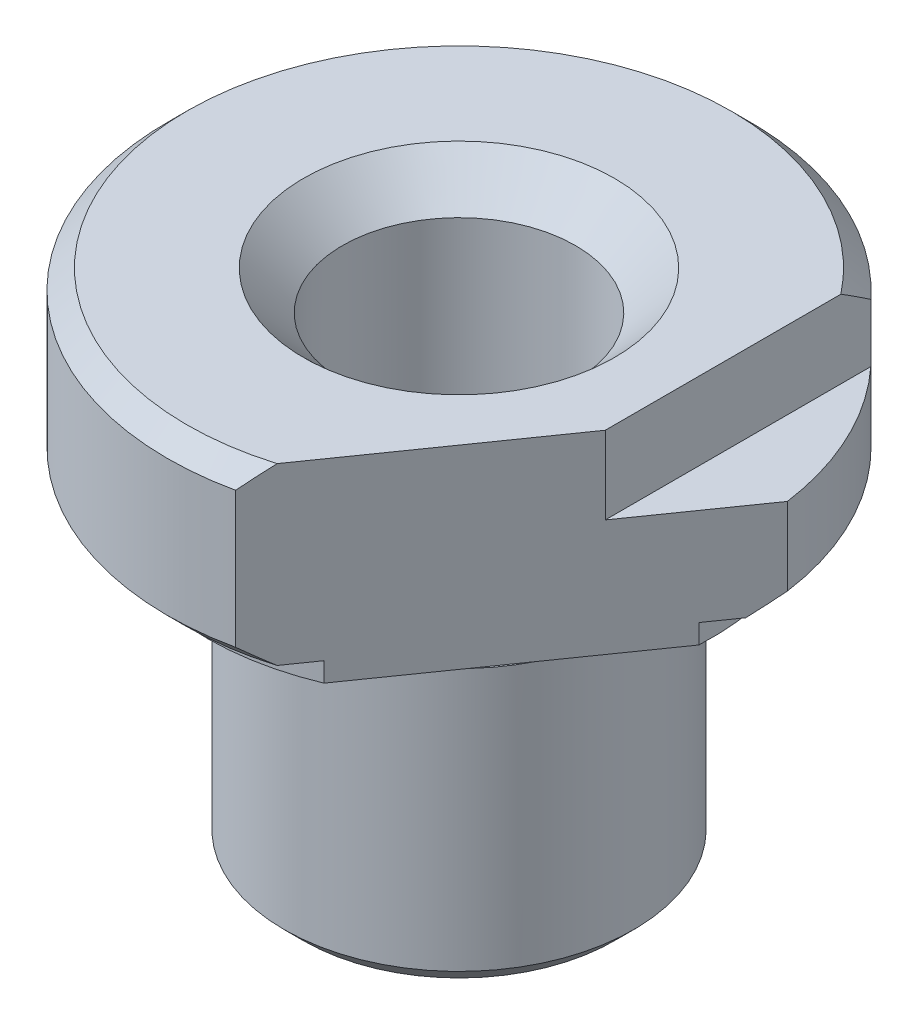
ISO-10303-21;
HEADER;
FILE_DESCRIPTION(('STEP AP214'),'2;1');
FILE_NAME('part.step','',(''),(''),'','','');
FILE_SCHEMA(('AUTOMOTIVE_DESIGN { 1 0 10303 214 1 1 1 1 }'));
ENDSEC;
DATA;
#1=APPLICATION_CONTEXT('core data for automotive mechanical design processes');
#2=APPLICATION_PROTOCOL_DEFINITION('international standard','automotive_design',2000,#1);
#3=PRODUCT_CONTEXT('',#1,'mechanical');
#4=PRODUCT('Part','Part','',(#3));
#5=PRODUCT_RELATED_PRODUCT_CATEGORY('part','',(#4));
#6=PRODUCT_DEFINITION_FORMATION('','',#4);
#7=PRODUCT_DEFINITION_CONTEXT('part definition',#1,'design');
#8=PRODUCT_DEFINITION('design','',#6,#7);
#9=PRODUCT_DEFINITION_SHAPE('','',#8);
#10=(LENGTH_UNIT() NAMED_UNIT(*) SI_UNIT(.MILLI.,.METRE.));
#11=(NAMED_UNIT(*) PLANE_ANGLE_UNIT() SI_UNIT($,.RADIAN.));
#12=(NAMED_UNIT(*) SI_UNIT($,.STERADIAN.) SOLID_ANGLE_UNIT());
#13=UNCERTAINTY_MEASURE_WITH_UNIT(LENGTH_MEASURE(1.E-05),#10,'distance_accuracy_value','');
#14=(GEOMETRIC_REPRESENTATION_CONTEXT(3) GLOBAL_UNCERTAINTY_ASSIGNED_CONTEXT((#13)) GLOBAL_UNIT_ASSIGNED_CONTEXT((#10,
#11,#12)) REPRESENTATION_CONTEXT('',''));
#15=CARTESIAN_POINT('',(0.,0.,0.));
#16=DIRECTION('',(0.,0.,1.));
#17=DIRECTION('',(1.,0.,0.));
#18=AXIS2_PLACEMENT_3D('',#15,#16,#17);
#19=CARTESIAN_POINT('',(0.,26.,0.));
#20=DIRECTION('',(0.,1.,0.));
#21=DIRECTION('',(0.,0.,1.));
#22=AXIS2_PLACEMENT_3D('',#19,#20,#21);
#23=CYLINDRICAL_SURFACE('',#22,8.);
#24=CARTESIAN_POINT('',(0.,16.5,0.));
#25=DIRECTION('',(0.,1.,0.));
#26=DIRECTION('',(0.,0.,1.));
#27=AXIS2_PLACEMENT_3D('',#24,#25,#26);
#28=CIRCLE('',#27,8.);
#29=CARTESIAN_POINT('',(0.,16.5,8.));
#30=VERTEX_POINT('',#29);
#31=EDGE_CURVE('E134',#30,#30,#28,.T.);
#32=ORIENTED_EDGE('',*,*,#31,.F.);
#33=EDGE_LOOP('',(#32));
#34=FACE_BOUND('',#33,.T.);
#35=CARTESIAN_POINT('',(0.,15.,0.));
#36=DIRECTION('',(0.,1.,0.));
#37=DIRECTION('',(0.,0.,1.));
#38=AXIS2_PLACEMENT_3D('',#35,#36,#37);
#39=CIRCLE('',#38,8.);
#40=CARTESIAN_POINT('',(0.,15.,8.));
#41=VERTEX_POINT('',#40);
#42=EDGE_CURVE('E137',#41,#41,#39,.T.);
#43=ORIENTED_EDGE('',*,*,#42,.T.);
#44=EDGE_LOOP('',(#43));
#45=FACE_BOUND('',#44,.T.);
#46=ADVANCED_FACE('F40',(#34,#45),#23,.T.);
#47=CARTESIAN_POINT('',(0.,16.5,0.));
#48=DIRECTION('',(0.,1.,0.));
#49=DIRECTION('',(0.,0.,1.));
#50=AXIS2_PLACEMENT_3D('',#47,#48,#49);
#51=PLANE('',#50);
#52=CARTESIAN_POINT('',(0.,16.5,0.));
#53=DIRECTION('',(0.,1.,0.));
#54=DIRECTION('',(0.,0.,1.));
#55=AXIS2_PLACEMENT_3D('',#52,#53,#54);
#56=CIRCLE('',#55,10.);
#57=CARTESIAN_POINT('',(0.,16.5,10.));
#58=VERTEX_POINT('',#57);
#59=EDGE_CURVE('E149',#58,#58,#56,.T.);
#60=ORIENTED_EDGE('',*,*,#59,.F.);
#61=EDGE_LOOP('',(#60));
#62=FACE_BOUND('',#61,.T.);
#63=ORIENTED_EDGE('',*,*,#31,.T.);
#64=EDGE_LOOP('',(#63));
#65=FACE_BOUND('',#64,.T.);
#66=ADVANCED_FACE('F197',(#62,#65),#51,.F.);
#67=CARTESIAN_POINT('',(0.,15.,0.));
#68=DIRECTION('',(0.,-1.,0.));
#69=DIRECTION('',(0.,0.,-1.));
#70=AXIS2_PLACEMENT_3D('',#67,#68,#69);
#71=PLANE('',#70);
#72=CARTESIAN_POINT('',(0.,15.,0.));
#73=DIRECTION('',(0.,-1.,0.));
#74=DIRECTION('',(0.,0.,-1.));
#75=AXIS2_PLACEMENT_3D('',#72,#73,#74);
#76=CIRCLE('',#75,8.49999999999999);
#77=CARTESIAN_POINT('',(0.,15.,-8.49999999999999));
#78=VERTEX_POINT('',#77);
#79=EDGE_CURVE('E179',#78,#78,#76,.F.);
#80=ORIENTED_EDGE('',*,*,#79,.T.);
#81=EDGE_LOOP('',(#80));
#82=FACE_BOUND('',#81,.T.);
#83=ORIENTED_EDGE('',*,*,#42,.F.);
#84=EDGE_LOOP('',(#83));
#85=FACE_BOUND('',#84,.T.);
#86=ADVANCED_FACE('F199',(#82,#85),#71,.F.);
#87=CARTESIAN_POINT('',(0.,26.,0.));
#88=DIRECTION('',(0.,1.,0.));
#89=DIRECTION('',(0.,0.,1.));
#90=AXIS2_PLACEMENT_3D('',#87,#88,#89);
#91=CYLINDRICAL_SURFACE('',#90,9.);
#92=CARTESIAN_POINT('',(0.,14.5,0.));
#93=DIRECTION('',(0.,-1.,0.));
#94=DIRECTION('',(0.,0.,-1.));
#95=AXIS2_PLACEMENT_3D('',#92,#93,#94);
#96=CIRCLE('',#95,9.);
#97=CARTESIAN_POINT('',(0.,14.5,-9.));
#98=VERTEX_POINT('',#97);
#99=EDGE_CURVE('E278',#98,#98,#96,.T.);
#100=ORIENTED_EDGE('',*,*,#99,.T.);
#101=EDGE_LOOP('',(#100));
#102=FACE_BOUND('',#101,.T.);
#103=CARTESIAN_POINT('',(0.,1.00000000000001,0.));
#104=DIRECTION('',(0.,1.,0.));
#105=DIRECTION('',(0.,0.,1.));
#106=AXIS2_PLACEMENT_3D('',#103,#104,#105);
#107=CIRCLE('',#106,9.);
#108=CARTESIAN_POINT('',(0.,1.00000000000001,9.));
#109=VERTEX_POINT('',#108);
#110=EDGE_CURVE('E158',#109,#109,#107,.T.);
#111=ORIENTED_EDGE('',*,*,#110,.T.);
#112=EDGE_LOOP('',(#111));
#113=FACE_BOUND('',#112,.T.);
#114=ADVANCED_FACE('F202',(#102,#113),#91,.T.);
#115=CARTESIAN_POINT('',(0.,0.,0.));
#116=DIRECTION('',(0.,1.,0.));
#117=DIRECTION('',(0.,0.,1.));
#118=AXIS2_PLACEMENT_3D('',#115,#116,#117);
#119=PLANE('',#118);
#120=CARTESIAN_POINT('',(0.,0.,0.));
#121=DIRECTION('',(0.,1.,0.));
#122=DIRECTION('',(0.,0.,1.));
#123=AXIS2_PLACEMENT_3D('',#120,#121,#122);
#124=CIRCLE('',#123,6.5);
#125=CARTESIAN_POINT('',(0.,0.,6.5));
#126=VERTEX_POINT('',#125);
#127=EDGE_CURVE('E54',#126,#126,#124,.T.);
#128=ORIENTED_EDGE('',*,*,#127,.T.);
#129=EDGE_LOOP('',(#128));
#130=FACE_BOUND('',#129,.T.);
#131=CARTESIAN_POINT('',(0.,0.,0.));
#132=DIRECTION('',(0.,1.,0.));
#133=DIRECTION('',(0.,0.,1.));
#134=AXIS2_PLACEMENT_3D('',#131,#132,#133);
#135=CIRCLE('',#134,7.99999999999998);
#136=CARTESIAN_POINT('',(0.,0.,7.99999999999998));
#137=VERTEX_POINT('',#136);
#138=EDGE_CURVE('E161',#137,#137,#135,.F.);
#139=ORIENTED_EDGE('',*,*,#138,.T.);
#140=EDGE_LOOP('',(#139));
#141=FACE_BOUND('',#140,.T.);
#142=ADVANCED_FACE('F194',(#130,#141),#119,.F.);
#143=CARTESIAN_POINT('',(0.,26.,0.));
#144=DIRECTION('',(0.,1.,0.));
#145=DIRECTION('',(0.,0.,1.));
#146=AXIS2_PLACEMENT_3D('',#143,#144,#145);
#147=CYLINDRICAL_SURFACE('',#146,15.);
#148=CARTESIAN_POINT('',(0.,18.,0.));
#149=DIRECTION('',(0.,-1.,0.));
#150=DIRECTION('',(0.,0.,-1.));
#151=AXIS2_PLACEMENT_3D('',#148,#149,#150);
#152=CIRCLE('',#151,15.);
#153=CARTESIAN_POINT('',(14.8600273701609,18.,-2.0444037169964));
#154=VERTEX_POINT('',#153);
#155=CARTESIAN_POINT('',(3.16131760419685,18.,14.6630853167195));
#156=VERTEX_POINT('',#155);
#157=EDGE_CURVE('E166',#154,#156,#152,.F.);
#158=ORIENTED_EDGE('',*,*,#157,.T.);
#159=DIRECTION('',(0.,1.,0.));
#160=VECTOR('',#159,1.);
#161=CARTESIAN_POINT('',(3.16131760419685,16.,14.6630853167195));
#162=LINE('',#161,#160);
#163=CARTESIAN_POINT('',(3.16131760419685,25.,14.6630853167195));
#164=VERTEX_POINT('',#163);
#165=EDGE_CURVE('E255',#156,#164,#162,.T.);
#166=ORIENTED_EDGE('',*,*,#165,.T.);
#167=CARTESIAN_POINT('',(0.,25.,0.));
#168=DIRECTION('',(0.,-1.,0.));
#169=DIRECTION('',(0.,0.,-1.));
#170=AXIS2_PLACEMENT_3D('',#167,#168,#169);
#171=CIRCLE('',#170,15.);
#172=CARTESIAN_POINT('',(11.,25.,-10.1980390271856));
#173=VERTEX_POINT('',#172);
#174=EDGE_CURVE('E164',#164,#173,#171,.T.);
#175=ORIENTED_EDGE('',*,*,#174,.T.);
#176=DIRECTION('',(0.,1.,0.));
#177=VECTOR('',#176,1.);
#178=CARTESIAN_POINT('',(11.,22.,-10.1980390271856));
#179=LINE('',#178,#177);
#180=CARTESIAN_POINT('',(11.,22.,-10.1980390271856));
#181=VERTEX_POINT('',#180);
#182=EDGE_CURVE('E132',#181,#173,#179,.T.);
#183=ORIENTED_EDGE('',*,*,#182,.F.);
#184=CARTESIAN_POINT('',(0.,22.,0.));
#185=DIRECTION('',(0.,1.,0.));
#186=DIRECTION('',(0.,0.,1.));
#187=AXIS2_PLACEMENT_3D('',#184,#185,#186);
#188=CIRCLE('',#187,15.);
#189=CARTESIAN_POINT('',(14.8600273701609,22.,-2.0444037169964));
#190=VERTEX_POINT('',#189);
#191=EDGE_CURVE('E126',#190,#181,#188,.T.);
#192=ORIENTED_EDGE('',*,*,#191,.F.);
#193=DIRECTION('',(0.,1.,0.));
#194=VECTOR('',#193,1.);
#195=CARTESIAN_POINT('',(14.8600273701609,16.,-2.0444037169964));
#196=LINE('',#195,#194);
#197=EDGE_CURVE('E257',#154,#190,#196,.T.);
#198=ORIENTED_EDGE('',*,*,#197,.F.);
#199=EDGE_LOOP('',(#158,#166,#175,#183,#192,#198));
#200=FACE_BOUND('',#199,.T.);
#201=ADVANCED_FACE('F209',(#200),#147,.T.);
#202=CARTESIAN_POINT('',(0.,26.,0.));
#203=DIRECTION('',(0.,-1.,0.));
#204=DIRECTION('',(0.,0.,-1.));
#205=AXIS2_PLACEMENT_3D('',#202,#203,#204);
#206=PLANE('',#205);
#207=CARTESIAN_POINT('',(0.,26.,0.));
#208=DIRECTION('',(0.,-1.,0.));
#209=DIRECTION('',(0.,0.,-1.));
#210=AXIS2_PLACEMENT_3D('',#207,#208,#209);
#211=CIRCLE('',#210,8.);
#212=CARTESIAN_POINT('',(0.,26.,-8.));
#213=VERTEX_POINT('',#212);
#214=EDGE_CURVE('E152',#213,#213,#211,.T.);
#215=ORIENTED_EDGE('',*,*,#214,.T.);
#216=EDGE_LOOP('',(#215));
#217=FACE_BOUND('',#216,.T.);
#218=CARTESIAN_POINT('',(0.,26.,0.));
#219=DIRECTION('',(0.,-1.,0.));
#220=DIRECTION('',(0.,0.,-1.));
#221=AXIS2_PLACEMENT_3D('',#218,#219,#220);
#222=CIRCLE('',#221,14.);
#223=CARTESIAN_POINT('',(11.,26.,-8.66025403784439));
#224=VERTEX_POINT('',#223);
#225=CARTESIAN_POINT('',(4.0433548382573,26.,13.4034055990237));
#226=VERTEX_POINT('',#225);
#227=EDGE_CURVE('E122',#224,#226,#222,.F.);
#228=ORIENTED_EDGE('',*,*,#227,.T.);
#229=DIRECTION('',(-0.57357643635105,0.,0.819152044288989));
#230=VECTOR('',#229,1.);
#231=CARTESIAN_POINT('',(3.16131760419685,26.,14.6630853167195));
#232=LINE('',#231,#230);
#233=CARTESIAN_POINT('',(11.,26.,3.46828667766885));
#234=VERTEX_POINT('',#233);
#235=EDGE_CURVE('E60',#234,#226,#232,.T.);
#236=ORIENTED_EDGE('',*,*,#235,.F.);
#237=DIRECTION('',(0.,0.,1.));
#238=VECTOR('',#237,1.);
#239=CARTESIAN_POINT('',(11.,26.,-10.1980390271856));
#240=LINE('',#239,#238);
#241=EDGE_CURVE('E116',#224,#234,#240,.T.);
#242=ORIENTED_EDGE('',*,*,#241,.F.);
#243=EDGE_LOOP('',(#228,#236,#242));
#244=FACE_BOUND('',#243,.T.);
#245=ADVANCED_FACE('F120',(#217,#244),#206,.F.);
#246=CARTESIAN_POINT('',(0.,17.,0.));
#247=DIRECTION('',(0.,-1.,0.));
#248=DIRECTION('',(0.,0.,-1.));
#249=AXIS2_PLACEMENT_3D('',#246,#247,#248);
#250=PLANE('',#249);
#251=DIRECTION('',(0.57357643635105,0.,-0.819152044288989));
#252=VECTOR('',#251,1.);
#253=CARTESIAN_POINT('',(9.01067248717887,17.,6.30934079986156));
#254=LINE('',#253,#252);
#255=CARTESIAN_POINT('',(4.04335483825708,17.0000000000001,13.4034055990241));
#256=VERTEX_POINT('',#255);
#257=CARTESIAN_POINT('',(5.03681836804161,17.,11.9845926391913));
#258=VERTEX_POINT('',#257);
#259=EDGE_CURVE('E319',#256,#258,#254,.T.);
#260=ORIENTED_EDGE('',*,*,#259,.F.);
#261=CARTESIAN_POINT('',(0.,17.,0.));
#262=DIRECTION('',(0.,-1.,0.));
#263=DIRECTION('',(0.,0.,-1.));
#264=AXIS2_PLACEMENT_3D('',#261,#262,#263);
#265=CIRCLE('',#264,14.);
#266=CARTESIAN_POINT('',(13.9779901361004,17.,-0.784723999300637));
#267=VERTEX_POINT('',#266);
#268=EDGE_CURVE('E169',#256,#267,#265,.T.);
#269=ORIENTED_EDGE('',*,*,#268,.T.);
#270=CARTESIAN_POINT('',(12.9845266063161,17.,0.634088960531777));
#271=VERTEX_POINT('',#270);
#272=EDGE_CURVE('E254',#271,#267,#254,.T.);
#273=ORIENTED_EDGE('',*,*,#272,.F.);
#274=CARTESIAN_POINT('',(0.,17.,0.));
#275=DIRECTION('',(0.,1.,0.));
#276=DIRECTION('',(0.,0.,1.));
#277=AXIS2_PLACEMENT_3D('',#274,#275,#276);
#278=CIRCLE('',#277,13.);
#279=EDGE_CURVE('E140',#271,#258,#278,.T.);
#280=ORIENTED_EDGE('',*,*,#279,.T.);
#281=EDGE_LOOP('',(#260,#269,#273,#280));
#282=FACE_BOUND('',#281,.T.);
#283=ADVANCED_FACE('F213',(#282),#250,.T.);
#284=CARTESIAN_POINT('',(0.,26.,0.));
#285=DIRECTION('',(0.,1.,0.));
#286=DIRECTION('',(0.,0.,1.));
#287=AXIS2_PLACEMENT_3D('',#284,#285,#286);
#288=CYLINDRICAL_SURFACE('',#287,13.);
#289=DIRECTION('',(0.,1.,0.));
#290=VECTOR('',#289,1.);
#291=CARTESIAN_POINT('',(5.03681836804161,26.,11.9845926391913));
#292=LINE('',#291,#290);
#293=CARTESIAN_POINT('',(5.03681836804162,16.,11.9845926391913));
#294=VERTEX_POINT('',#293);
#295=EDGE_CURVE('E316',#258,#294,#292,.F.);
#296=ORIENTED_EDGE('',*,*,#295,.F.);
#297=ORIENTED_EDGE('',*,*,#279,.F.);
#298=DIRECTION('',(0.,1.,0.));
#299=VECTOR('',#298,1.);
#300=CARTESIAN_POINT('',(12.9845266063161,26.,0.634088960531781));
#301=LINE('',#300,#299);
#302=CARTESIAN_POINT('',(12.9845266063161,16.,0.634088960531784));
#303=VERTEX_POINT('',#302);
#304=EDGE_CURVE('E317',#303,#271,#301,.T.);
#305=ORIENTED_EDGE('',*,*,#304,.F.);
#306=CARTESIAN_POINT('',(0.,16.,0.));
#307=DIRECTION('',(0.,1.,0.));
#308=DIRECTION('',(0.,0.,1.));
#309=AXIS2_PLACEMENT_3D('',#306,#307,#308);
#310=CIRCLE('',#309,13.);
#311=EDGE_CURVE('E143',#303,#294,#310,.T.);
#312=ORIENTED_EDGE('',*,*,#311,.T.);
#313=EDGE_LOOP('',(#296,#297,#305,#312));
#314=FACE_BOUND('',#313,.T.);
#315=ADVANCED_FACE('F220',(#314),#288,.T.);
#316=CARTESIAN_POINT('',(0.,16.,0.));
#317=DIRECTION('',(0.,1.,0.));
#318=DIRECTION('',(0.,0.,1.));
#319=AXIS2_PLACEMENT_3D('',#316,#317,#318);
#320=PLANE('',#319);
#321=ORIENTED_EDGE('',*,*,#311,.F.);
#322=DIRECTION('',(-0.57357643635105,0.,0.819152044288989));
#323=VECTOR('',#322,1.);
#324=CARTESIAN_POINT('',(3.16131760419685,16.,14.6630853167195));
#325=LINE('',#324,#323);
#326=EDGE_CURVE('E123',#303,#294,#325,.T.);
#327=ORIENTED_EDGE('',*,*,#326,.T.);
#328=EDGE_LOOP('',(#321,#327));
#329=FACE_BOUND('',#328,.T.);
#330=CARTESIAN_POINT('',(0.,16.,0.));
#331=DIRECTION('',(0.,1.,0.));
#332=DIRECTION('',(0.,0.,1.));
#333=AXIS2_PLACEMENT_3D('',#330,#331,#332);
#334=CIRCLE('',#333,10.);
#335=CARTESIAN_POINT('',(0.,16.,10.));
#336=VERTEX_POINT('',#335);
#337=EDGE_CURVE('E146',#336,#336,#334,.T.);
#338=ORIENTED_EDGE('',*,*,#337,.T.);
#339=EDGE_LOOP('',(#338));
#340=FACE_BOUND('',#339,.T.);
#341=ADVANCED_FACE('F224',(#329,#340),#320,.F.);
#342=CARTESIAN_POINT('',(0.,26.,0.));
#343=DIRECTION('',(0.,1.,0.));
#344=DIRECTION('',(0.,0.,1.));
#345=AXIS2_PLACEMENT_3D('',#342,#343,#344);
#346=CYLINDRICAL_SURFACE('',#345,10.);
#347=ORIENTED_EDGE('',*,*,#337,.F.);
#348=EDGE_LOOP('',(#347));
#349=FACE_BOUND('',#348,.T.);
#350=ORIENTED_EDGE('',*,*,#59,.T.);
#351=EDGE_LOOP('',(#350));
#352=FACE_BOUND('',#351,.T.);
#353=ADVANCED_FACE('F192',(#349,#352),#346,.F.);
#354=CARTESIAN_POINT('',(0.,26.,0.));
#355=DIRECTION('',(0.,-1.,0.));
#356=DIRECTION('',(0.,0.,-1.));
#357=AXIS2_PLACEMENT_3D('',#354,#355,#356);
#358=CYLINDRICAL_SURFACE('',#357,6.);
#359=CARTESIAN_POINT('',(0.,0.5,0.));
#360=DIRECTION('',(0.,1.,0.));
#361=DIRECTION('',(0.,0.,1.));
#362=AXIS2_PLACEMENT_3D('',#359,#360,#361);
#363=CIRCLE('',#362,6.);
#364=CARTESIAN_POINT('',(0.,0.5,6.));
#365=VERTEX_POINT('',#364);
#366=EDGE_CURVE('E277',#365,#365,#363,.F.);
#367=ORIENTED_EDGE('',*,*,#366,.T.);
#368=EDGE_LOOP('',(#367));
#369=FACE_BOUND('',#368,.T.);
#370=CARTESIAN_POINT('',(0.,24.,0.));
#371=DIRECTION('',(0.,-1.,0.));
#372=DIRECTION('',(0.,0.,-1.));
#373=AXIS2_PLACEMENT_3D('',#370,#371,#372);
#374=CIRCLE('',#373,6.);
#375=CARTESIAN_POINT('',(0.,24.,-6.));
#376=VERTEX_POINT('',#375);
#377=EDGE_CURVE('E155',#376,#376,#374,.F.);
#378=ORIENTED_EDGE('',*,*,#377,.T.);
#379=EDGE_LOOP('',(#378));
#380=FACE_BOUND('',#379,.T.);
#381=ADVANCED_FACE('F189',(#369,#380),#358,.F.);
#382=CARTESIAN_POINT('',(11.,22.,-10.1980390271856));
#383=DIRECTION('',(-1.,0.,0.));
#384=DIRECTION('',(0.,0.,1.));
#385=AXIS2_PLACEMENT_3D('',#382,#383,#384);
#386=PLANE('',#385);
#387=ORIENTED_EDGE('',*,*,#241,.T.);
#388=DIRECTION('',(0.,-1.,0.));
#389=VECTOR('',#388,1.);
#390=CARTESIAN_POINT('',(11.,22.,3.46828667766885));
#391=LINE('',#390,#389);
#392=CARTESIAN_POINT('',(11.,22.,3.46828667766884));
#393=VERTEX_POINT('',#392);
#394=EDGE_CURVE('E110',#234,#393,#391,.T.);
#395=ORIENTED_EDGE('',*,*,#394,.T.);
#396=DIRECTION('',(0.,0.,1.));
#397=VECTOR('',#396,1.);
#398=CARTESIAN_POINT('',(11.,22.,-10.1980390271856));
#399=LINE('',#398,#397);
#400=EDGE_CURVE('E128',#181,#393,#399,.T.);
#401=ORIENTED_EDGE('',*,*,#400,.F.);
#402=ORIENTED_EDGE('',*,*,#182,.T.);
#403=CARTESIAN_POINT('',(11.,25.,-10.1980390271856));
#404=CARTESIAN_POINT('',(11.,25.0859534985509,-10.0716097932226));
#405=CARTESIAN_POINT('',(11.,25.1713222713732,-9.94478168559514));
#406=CARTESIAN_POINT('',(11.,25.3407786548004,-9.69029386318123));
#407=CARTESIAN_POINT('',(11.,25.4248664125517,-9.56263424634969));
#408=CARTESIAN_POINT('',(11.,25.591670016424,-9.30641873923805));
#409=CARTESIAN_POINT('',(11.,25.6743858458112,-9.17786283805277));
#410=CARTESIAN_POINT('',(11.,25.8383361007494,-8.91978924484244));
#411=CARTESIAN_POINT('',(11.,25.9195703536757,-8.79027144318522));
#412=CARTESIAN_POINT('',(11.,26.,-8.66025403784439));
#413=B_SPLINE_CURVE_WITH_KNOTS('',3,(#403,#404,#405,#406,#407,#408,#409,#410,#411,#412),
.UNSPECIFIED.,.F.,.F.,(4,2,2,2,4),(0.,0.458640555019231,0.917228023923435,1.3758210822705,
1.83446723618275),.UNSPECIFIED.);
#414=EDGE_CURVE('E68',#173,#224,#413,.T.);
#415=ORIENTED_EDGE('',*,*,#414,.T.);
#416=EDGE_LOOP('',(#387,#395,#401,#402,#415));
#417=FACE_BOUND('',#416,.T.);
#418=ADVANCED_FACE('F125',(#417),#386,.F.);
#419=CARTESIAN_POINT('',(0.,22.,0.));
#420=DIRECTION('',(0.,1.,0.));
#421=DIRECTION('',(0.,0.,1.));
#422=AXIS2_PLACEMENT_3D('',#419,#420,#421);
#423=PLANE('',#422);
#424=DIRECTION('',(-0.57357643635105,0.,0.819152044288989));
#425=VECTOR('',#424,1.);
#426=CARTESIAN_POINT('',(9.01067248717888,22.,6.30934079986155));
#427=LINE('',#426,#425);
#428=EDGE_CURVE('E113',#190,#393,#427,.T.);
#429=ORIENTED_EDGE('',*,*,#428,.F.);
#430=ORIENTED_EDGE('',*,*,#191,.T.);
#431=ORIENTED_EDGE('',*,*,#400,.T.);
#432=EDGE_LOOP('',(#429,#430,#431));
#433=FACE_BOUND('',#432,.T.);
#434=ADVANCED_FACE('F188',(#433),#423,.T.);
#435=CARTESIAN_POINT('',(0.,26.,0.));
#436=DIRECTION('',(0.,1.,0.));
#437=DIRECTION('',(0.,0.,1.));
#438=AXIS2_PLACEMENT_3D('',#435,#436,#437);
#439=CONICAL_SURFACE('',#438,8.,0.785398163397447);
#440=ORIENTED_EDGE('',*,*,#377,.F.);
#441=EDGE_LOOP('',(#440));
#442=FACE_BOUND('',#441,.T.);
#443=ORIENTED_EDGE('',*,*,#214,.F.);
#444=EDGE_LOOP('',(#443));
#445=FACE_BOUND('',#444,.T.);
#446=ADVANCED_FACE('F235',(#442,#445),#439,.F.);
#447=CARTESIAN_POINT('',(0.,1.00000000000001,0.));
#448=DIRECTION('',(0.,1.,0.));
#449=DIRECTION('',(0.,0.,1.));
#450=AXIS2_PLACEMENT_3D('',#447,#448,#449);
#451=CONICAL_SURFACE('',#450,9.,0.785398163397453);
#452=ORIENTED_EDGE('',*,*,#138,.F.);
#453=EDGE_LOOP('',(#452));
#454=FACE_BOUND('',#453,.T.);
#455=ORIENTED_EDGE('',*,*,#110,.F.);
#456=EDGE_LOOP('',(#455));
#457=FACE_BOUND('',#456,.T.);
#458=ADVANCED_FACE('F238',(#454,#457),#451,.T.);
#459=CARTESIAN_POINT('',(0.,18.,0.));
#460=DIRECTION('',(0.,1.,0.));
#461=DIRECTION('',(0.,0.,1.));
#462=AXIS2_PLACEMENT_3D('',#459,#460,#461);
#463=CONICAL_SURFACE('',#462,15.,0.785398163397454);
#464=CARTESIAN_POINT('',(-5.29084725455643,30.2525467139973,26.7340277124036));
#465=CARTESIAN_POINT('',(-5.08043013339517,29.9169170292778,26.4335209202328));
#466=CARTESIAN_POINT('',(-4.86967343911738,29.5819327501249,26.1325291673924));
#467=CARTESIAN_POINT('',(-4.44738046274961,28.9134551953034,25.5294322949316));
#468=CARTESIAN_POINT('',(-4.23584417411731,28.5799619321994,25.2273271659677));
#469=CARTESIAN_POINT('',(-3.81184362216552,27.9145914661765,24.6217916228402));
#470=CARTESIAN_POINT('',(-3.59937914594874,27.5827146754166,24.3183609046277));
#471=CARTESIAN_POINT('',(-3.17345275225381,26.9209130745991,23.7100749744535));
#472=CARTESIAN_POINT('',(-2.95999083693992,26.5909882603098,23.4052197655826));
#473=CARTESIAN_POINT('',(-2.5304588240863,25.9311380560432,22.7917844775938));
#474=CARTESIAN_POINT('',(-2.31438087950258,25.6012281833536,22.4831931917356));
#475=CARTESIAN_POINT('',(-1.88089593842366,24.9440731737241,21.864112537181));
#476=CARTESIAN_POINT('',(-1.6634889452251,24.616828030179,21.5536231731927));
#477=CARTESIAN_POINT('',(-1.22716246521827,23.9655070421263,20.9304843804821));
#478=CARTESIAN_POINT('',(-1.00824316218532,23.6414308237034,20.6178352142183));
#479=CARTESIAN_POINT('',(-0.568614374505926,22.9969888729641,19.9899802373875));
#480=CARTESIAN_POINT('',(-0.347904897598934,22.6766231246208,19.6747744378737));
#481=CARTESIAN_POINT('',(0.0598360958597873,22.0916652236628,19.0924599507986));
#482=CARTESIAN_POINT('',(0.246556188888957,21.8264136503625,18.8257960221203));
#483=CARTESIAN_POINT('',(0.621692227863746,21.2995826571833,18.2900462358013));
#484=CARTESIAN_POINT('',(0.810108157785128,21.0380032026656,18.0209604010456));
#485=CARTESIAN_POINT('',(1.18895604575634,20.5191061371038,17.4799095449811));
#486=CARTESIAN_POINT('',(1.37938859727559,20.2617898412071,17.20794367611));
#487=CARTESIAN_POINT('',(1.76252434967123,19.7523443252465,16.6607691150146));
#488=CARTESIAN_POINT('',(1.95522753112608,19.5002150608665,16.3855604505269));
#489=CARTESIAN_POINT('',(2.34302529497771,19.0025331700527,15.8317278470632));
#490=CARTESIAN_POINT('',(2.53811641924448,18.7569723717368,15.5531088468086));
#491=CARTESIAN_POINT('',(2.93138823042472,18.2734332833661,14.9914584935636));
#492=CARTESIAN_POINT('',(3.12956905720496,18.03545533807,14.7084269408229));
#493=CARTESIAN_POINT('',(3.52943415992286,17.5689661335547,14.1373603914106));
#494=CARTESIAN_POINT('',(3.73111665353511,17.340450247737,13.8493279401635));
#495=CARTESIAN_POINT('',(4.13865634377312,16.8950750539122,13.2673009438818));
#496=CARTESIAN_POINT('',(4.34451298562002,16.6782142106591,12.9733071911535));
#497=CARTESIAN_POINT('',(4.75714262589975,16.26308659656,12.3840109928653));
#498=CARTESIAN_POINT('',(4.96382415738633,16.0645451312596,12.0888391756424));
#499=CARTESIAN_POINT('',(5.38254303150619,15.6851907440499,11.4908466501828));
#500=CARTESIAN_POINT('',(5.59458089705361,15.5043795615437,11.1880251951474));
#501=CARTESIAN_POINT('',(6.02424937793896,15.1654430954633,10.5743950106111));
#502=CARTESIAN_POINT('',(6.2418719723288,15.0072872121233,10.2635977362112));
#503=CARTESIAN_POINT('',(6.68320665364539,14.7191633272258,9.63330649078274));
#504=CARTESIAN_POINT('',(6.90691699674192,14.5891873472587,9.31381501020184));
#505=CARTESIAN_POINT('',(7.31515676532642,14.3862221269147,8.73078819842503));
#506=CARTESIAN_POINT('',(7.4986680648569,14.3070444663724,8.46870690178593));
#507=CARTESIAN_POINT('',(7.86873026428391,14.1742647858127,7.94020330930364));
#508=CARTESIAN_POINT('',(8.05528073316561,14.1206591712658,7.67378162901344));
#509=CARTESIAN_POINT('',(8.42991164825082,14.0417584769199,7.13875323437053));
#510=CARTESIAN_POINT('',(8.61798730452671,14.0163952587405,6.87015336074341));
#511=CARTESIAN_POINT('',(8.99469328303319,13.9951388615038,6.33216146841155));
#512=CARTESIAN_POINT('',(9.18332359966655,13.9992453860726,6.06276945770048));
#513=CARTESIAN_POINT('',(9.55944139471928,14.0366787768919,5.52561757839569));
#514=CARTESIAN_POINT('',(9.74692975070534,14.069979275878,5.25785645650685));
#515=CARTESIAN_POINT('',(10.1196141107425,14.163984116856,4.72560803057586));
#516=CARTESIAN_POINT('',(10.3048099169621,14.224690807111,4.46112100906629));
#517=CARTESIAN_POINT('',(10.672475873115,14.3708579642635,3.93603960663964));
#518=CARTESIAN_POINT('',(10.8549366989393,14.4563888200474,3.67545854193011));
#519=CARTESIAN_POINT('',(11.2160689336293,14.6487793211693,3.1597082607872));
#520=CARTESIAN_POINT('',(11.3947404350699,14.7556384447828,2.90453891214326));
#521=CARTESIAN_POINT('',(11.7970830672096,15.0194346137671,2.3299340840256));
#522=CARTESIAN_POINT('',(12.0195239649883,15.1820464364044,2.012255559245));
#523=CARTESIAN_POINT('',(12.4583741579796,15.5305480129974,1.3855125308661));
#524=CARTESIAN_POINT('',(12.6747802956124,15.7164496835621,1.07645253675901));
#525=CARTESIAN_POINT('',(13.102483572746,16.1068991994265,0.465628954043637));
#526=CARTESIAN_POINT('',(13.3137698814487,16.3114828344036,0.16388083341804));
#527=CARTESIAN_POINT('',(13.7314520792798,16.7350743887642,-0.432631164866191));
#528=CARTESIAN_POINT('',(13.9378487576448,16.954079958431,-0.727396169671282));
#529=CARTESIAN_POINT('',(14.3487596524215,17.4061117762957,-1.31423774499534));
#530=CARTESIAN_POINT('',(14.553226619977,17.6392679682578,-1.60624683715432));
#531=CARTESIAN_POINT('',(14.9585148492523,18.1150070195902,-2.1850584139498));
#532=CARTESIAN_POINT('',(15.159336001607,18.3575901610613,-2.47186074239682));
#533=CARTESIAN_POINT('',(15.5576358513849,18.8501107493877,-3.04069187894277));
#534=CARTESIAN_POINT('',(15.7551181019354,19.1000394868862,-3.32272576143348));
#535=CARTESIAN_POINT('',(16.147429957,19.606154585464,-3.88300515526531));
#536=CARTESIAN_POINT('',(16.3422594729759,19.8623411546124,-4.16125054016077));
#537=CARTESIAN_POINT('',(16.8369284842599,20.5232085383376,-4.86771110262313));
#538=CARTESIAN_POINT('',(17.1351607827303,20.9315439768151,-5.29363096522971));
#539=CARTESIAN_POINT('',(17.7272736500388,21.7576946882775,-6.13925577644265));
#540=CARTESIAN_POINT('',(18.0211540494605,22.175510328725,-6.55896048309735));
#541=CARTESIAN_POINT('',(18.6055637881443,23.0187489388677,-7.3935840865194));
#542=CARTESIAN_POINT('',(18.8960912277953,23.4441759031566,-7.80850027036074));
#543=CARTESIAN_POINT('',(19.4742903881988,24.3008880150004,-8.63425424879108));
#544=CARTESIAN_POINT('',(19.7619620797802,24.7321732222907,-9.04509200171905));
#545=CARTESIAN_POINT('',(20.3240836985806,25.5830109678824,-9.8478848711555));
#546=CARTESIAN_POINT('',(20.5986211929091,26.0023878830277,-10.2399650464568));
#547=CARTESIAN_POINT('',(21.1458741028141,26.8447440452008,-11.0215231989214));
#548=CARTESIAN_POINT('',(21.4185895046666,27.2677233193069,-11.411001156485));
#549=CARTESIAN_POINT('',(21.9622046127369,28.11624306601,-12.1873639895105));
#550=CARTESIAN_POINT('',(22.2331058855328,28.5417804907325,-12.5742511022778));
#551=CARTESIAN_POINT('',(22.7735851776704,29.3953804192205,-13.3461355260295));
#552=CARTESIAN_POINT('',(23.043163228237,29.8234428628716,-13.7311328816076));
#553=CARTESIAN_POINT('',(23.3121922289142,30.2525467139973,-14.1153461126805));
#554=B_SPLINE_CURVE_WITH_KNOTS('',3,(#464,#465,#466,#467,#468,#469,#470,#471,#472,#473,#474,
#475,#476,#477,#478,#479,#480,#481,#482,#483,#484,#485,#486,#487,#488,#489,#490,#491,#492,#493,
#494,#495,#496,#497,#498,#499,#500,#501,#502,#503,#504,#505,#506,#507,#508,#509,#510,#511,#512,
#513,#514,#515,#516,#517,#518,#519,#520,#521,#522,#523,#524,#525,#526,#527,#528,#529,#530,#531,
#532,#533,#534,#535,#536,#537,#538,#539,#540,#541,#542,#543,#544,#545,#546,#547,#548,#549,#550,
#551,#552,#553),.UNSPECIFIED.,.F.,.F.,(4,2,2,2,2,2,2,2,2,2,2,2,2,2,2,2,2,2,2,2,2,2,2,2,2,2,2,2,
2,2,2,2,2,2,2,2,2,2,2,2,2,2,2,2,4),(0.,1.49165867743962,2.98332990142495,4.47536340348668,
5.96739366962565,7.46965765027981,8.9719179061462,10.4739987113451,11.976073026068,
13.2358096128151,14.4955343085784,15.7556406420954,17.0157362052748,18.2741833508117,
19.5326876309654,20.7905691015714,22.0482844711417,23.2821404172913,24.5161172881996,
25.7484114262149,26.9803562151322,27.9682361942902,28.9559772713522,29.9413300987823,
30.9266730166462,31.911126913313,32.8956651776261,33.8830228374787,34.8703563479043,
36.1309221239293,37.392135542419,38.6558179360593,39.9192949491943,41.1969762183776,
42.4746957515819,43.7509570384135,45.027260818091,47.010480627731,48.9937774408316,
50.9781475820976,52.9625379728153,54.8716453293581,56.7807670490227,58.6879440384162,
60.5950758044497),.UNSPECIFIED.);
#555=EDGE_CURVE('E256',#156,#256,#554,.T.);
#556=ORIENTED_EDGE('',*,*,#555,.F.);
#557=ORIENTED_EDGE('',*,*,#157,.F.);
#558=EDGE_CURVE('E247',#267,#154,#554,.T.);
#559=ORIENTED_EDGE('',*,*,#558,.F.);
#560=ORIENTED_EDGE('',*,*,#268,.F.);
#561=EDGE_LOOP('',(#556,#557,#559,#560));
#562=FACE_BOUND('',#561,.T.);
#563=ADVANCED_FACE('F241',(#562),#463,.T.);
#564=CARTESIAN_POINT('',(0.,26.,0.));
#565=DIRECTION('',(0.,-1.,0.));
#566=DIRECTION('',(0.,0.,-1.));
#567=AXIS2_PLACEMENT_3D('',#564,#565,#566);
#568=CONICAL_SURFACE('',#567,14.,0.785398163397447);
#569=CARTESIAN_POINT('',(22.0894131075674,14.6833012310323,-12.3690365478432));
#570=CARTESIAN_POINT('',(21.8988003271426,14.9826111062078,-12.09681328542));
#571=CARTESIAN_POINT('',(21.7078389214845,15.2812448372018,-11.8240921345647));
#572=CARTESIAN_POINT('',(21.3251241177759,15.8769663603585,-11.2775187504976));
#573=CARTESIAN_POINT('',(21.13337071863,16.1740541503817,-11.0036665157213));
#574=CARTESIAN_POINT('',(20.556663603602,17.0628881503398,-10.1800433989202));
#575=CARTESIAN_POINT('',(20.1703794919339,17.6520216020615,-9.6283725148052));
#576=CARTESIAN_POINT('',(19.585522857322,18.5318428836106,-8.79311067785431));
#577=CARTESIAN_POINT('',(19.388646817566,18.8259608619448,-8.5119425541015));
#578=CARTESIAN_POINT('',(18.9935619545208,19.4114496766945,-7.94770289444956));
#579=CARTESIAN_POINT('',(18.7953531628818,19.7028205779556,-7.66463140375158));
#580=CARTESIAN_POINT('',(18.3974383751715,20.2823031872719,-7.09635019282988));
#581=CARTESIAN_POINT('',(18.1977326771936,20.5704155169963,-6.81114089832774));
#582=CARTESIAN_POINT('',(17.796528133511,21.1428883271602,-6.23816142897149));
#583=CARTESIAN_POINT('',(17.5950291313904,21.427248474848,-5.95039103073238));
#584=CARTESIAN_POINT('',(17.208966431359,21.9650035673747,-5.39903635520512));
#585=CARTESIAN_POINT('',(17.0245873016597,22.2188008834891,-5.13571566864028));
#586=CARTESIAN_POINT('',(16.6538782020317,22.7220251645424,-4.60628820692532));
#587=CARTESIAN_POINT('',(16.4675482579557,22.9714521872808,-4.34018146869678));
#588=CARTESIAN_POINT('',(16.0926512512725,23.4650724817849,-3.80477305586867));
#589=CARTESIAN_POINT('',(15.9040844507897,23.709266357562,-3.5354717556214));
#590=CARTESIAN_POINT('',(15.5243367876215,24.1913819465735,-2.99313588740281));
#591=CARTESIAN_POINT('',(15.3331560312282,24.4293039136992,-2.72010147123219));
#592=CARTESIAN_POINT('',(14.9481664664613,24.8970214287859,-2.17027939169382));
#593=CARTESIAN_POINT('',(14.7543643548694,25.1268336824096,-1.89350129232149));
#594=CARTESIAN_POINT('',(14.3632117073798,25.577165484086,-1.33487741847724));
#595=CARTESIAN_POINT('',(14.1658609765809,25.797684519489,-1.05303136565777));
#596=CARTESIAN_POINT('',(13.7672058707394,26.2270094971859,-0.483692870872624));
#597=CARTESIAN_POINT('',(13.5659047367693,26.4358245406145,-0.19620505763835));
#598=CARTESIAN_POINT('',(13.1586107719837,26.8389897581566,0.385471006328286));
#599=CARTESIAN_POINT('',(12.9526187544873,27.0333424152348,0.679658095520606));
#600=CARTESIAN_POINT('',(12.5482137547323,27.3923828140326,1.25720828983716));
#601=CARTESIAN_POINT('',(12.3501231976013,27.5581628411164,1.54011092415823));
#602=CARTESIAN_POINT('',(12.0491726403972,27.7918616306442,1.96991286255724));
#603=CARTESIAN_POINT('',(11.9482196610462,27.8672662431607,2.11408865879209));
#604=CARTESIAN_POINT('',(11.7449709495483,28.0125422026243,2.40435790099063));
#605=CARTESIAN_POINT('',(11.6426747428311,28.0824115290632,2.55045202471108));
#606=CARTESIAN_POINT('',(11.3343425509499,28.2824177517407,2.99079602996068));
#607=CARTESIAN_POINT('',(11.126305047237,28.4033928814763,3.28790437621588));
#608=CARTESIAN_POINT('',(10.7053239766923,28.6155319836237,3.88912765299039));
#609=CARTESIAN_POINT('',(10.4923828576911,28.7067104990658,4.19323908764545));
#610=CARTESIAN_POINT('',(10.095674141053,28.842860706686,4.75979785056938));
#611=CARTESIAN_POINT('',(9.9124701244332,28.8927889361492,5.02144030173205));
#612=CARTESIAN_POINT('',(9.54428895812347,28.965331125516,5.54725750051728));
#613=CARTESIAN_POINT('',(9.35931208239774,28.9879492392482,5.81143185687836));
#614=CARTESIAN_POINT('',(8.98912523580879,29.0046609686373,6.34011346395652));
#615=CARTESIAN_POINT('',(8.80391572481184,28.9987850195594,6.60462005791648));
#616=CARTESIAN_POINT('',(8.43449161271333,28.9589090079938,7.13221236725245));
#617=CARTESIAN_POINT('',(8.25027716124546,28.9249048280122,7.39529786892937));
#618=CARTESIAN_POINT('',(7.83547297648129,28.8179390887556,7.9876996385886));
#619=CARTESIAN_POINT('',(7.60555767064857,28.7370306007543,8.3160527243331));
#620=CARTESIAN_POINT('',(7.15094566075405,28.5385387568212,8.96530596010498));
#621=CARTESIAN_POINT('',(6.92625238636656,28.420931991331,9.28620121204982));
#622=CARTESIAN_POINT('',(6.5931739923556,28.2215852187712,9.76188645654545));
#623=CARTESIAN_POINT('',(6.4825105521544,28.1510887185694,9.919930228088));
#624=CARTESIAN_POINT('',(6.26274373551695,28.0032840812021,10.2337897692168));
#625=CARTESIAN_POINT('',(6.15363966803304,27.9259790773832,10.3896065257214));
#626=CARTESIAN_POINT('',(5.93693612938746,27.7652735855977,10.6990912524921));
#627=CARTESIAN_POINT('',(5.82933653477086,27.6818736013154,10.85275939907));
#628=CARTESIAN_POINT('',(5.61556896366536,27.5096270084017,11.1580511296505));
#629=CARTESIAN_POINT('',(5.50940117333856,27.4207796996857,11.3096744477859));
#630=CARTESIAN_POINT('',(5.23162038576673,27.1804342519075,11.7063865258679));
#631=CARTESIAN_POINT('',(5.06115396578938,27.0249022158317,11.949837803775));
#632=CARTESIAN_POINT('',(4.72354923391685,26.7031771559205,12.4319873286654));
#633=CARTESIAN_POINT('',(4.55641150652364,26.5369822809991,12.6706847408934));
#634=CARTESIAN_POINT('',(4.22503375493869,26.1956618850686,13.1439412162982));
#635=CARTESIAN_POINT('',(4.06079558429455,26.0205309113929,13.3784976323346));
#636=CARTESIAN_POINT('',(3.73499577801884,25.6629156839534,13.8437879762642));
#637=CARTESIAN_POINT('',(3.57343399958745,25.4804318243002,14.0745221080967));
#638=CARTESIAN_POINT('',(3.25225802824932,25.1088159486198,14.5332089313767));
#639=CARTESIAN_POINT('',(3.09264984489972,24.9196681815435,14.7611530402871));
#640=CARTESIAN_POINT('',(2.77552033663086,24.5361200431814,15.2140609154004));
#641=CARTESIAN_POINT('',(2.6179990881057,24.3417194803997,15.4390245725012));
#642=CARTESIAN_POINT('',(2.14830097280232,23.751994363496,16.1098229996422));
#643=CARTESIAN_POINT('',(1.83887357431327,23.350010313899,16.5517311220257));
#644=CARTESIAN_POINT('',(1.22437175332085,22.5311381047516,17.4293306728154));
#645=CARTESIAN_POINT('',(0.919323718479217,22.1141901784765,17.8649844157351));
#646=CARTESIAN_POINT('',(0.313795806997292,21.2702874234318,18.7297678955447));
#647=CARTESIAN_POINT('',(0.0133162154114198,20.8433319744192,19.1588972253348));
#648=CARTESIAN_POINT('',(-0.583564061375392,19.9822895327057,20.0113306028915));
#649=CARTESIAN_POINT('',(-0.879969740148514,19.5482130337541,20.4346417822184));
#650=CARTESIAN_POINT('',(-1.46980686951393,18.6739951744288,21.2770165028241));
#651=CARTESIAN_POINT('',(-1.76323839317483,18.2338539636819,21.6960801484557));
#652=CARTESIAN_POINT('',(-2.2668589639284,17.4710808280293,22.4153248627318));
#653=CARTESIAN_POINT('',(-2.47762843967064,17.1496115386506,22.7163348693951));
#654=CARTESIAN_POINT('',(-2.89810200466789,16.5043955988734,23.3168333531337));
#655=CARTESIAN_POINT('',(-3.10780584185583,16.1806484492473,23.6163214702198));
#656=CARTESIAN_POINT('',(-3.52484313929102,15.533411650065,24.211912455289));
#657=CARTESIAN_POINT('',(-3.73218308061335,15.2099346846738,24.5080245792065));
#658=CARTESIAN_POINT('',(-4.14596268038019,14.5614041132661,25.0989630898441));
#659=CARTESIAN_POINT('',(-4.3524025380025,14.2363508936048,25.3937897610195));
#660=CARTESIAN_POINT('',(-4.55847166491903,13.9105868924326,25.6880869738764));
#661=B_SPLINE_CURVE_WITH_KNOTS('',3,(#569,#570,#571,#572,#573,#574,#575,#576,#577,#578,#579,
#580,#581,#582,#583,#584,#585,#586,#587,#588,#589,#590,#591,#592,#593,#594,#595,#596,#597,#598,
#599,#600,#601,#602,#603,#604,#605,#606,#607,#608,#609,#610,#611,#612,#613,#614,#615,#616,#617,
#618,#619,#620,#621,#622,#623,#624,#625,#626,#627,#628,#629,#630,#631,#632,#633,#634,#635,#636,
#637,#638,#639,#640,#641,#642,#643,#644,#645,#646,#647,#648,#649,#650,#651,#652,#653,#654,#655,
#656,#657,#658,#659,#660),.UNSPECIFIED.,.F.,.F.,(4,2,2,2,2,2,2,2,2,2,2,2,2,2,2,2,2,2,2,2,2,2,2,
2,2,2,2,2,2,2,2,2,2,2,2,2,2,2,2,2,2,2,2,2,2,4),(0.,1.34172179723452,2.683445450876,
5.36771376922294,6.72375946907701,8.07977307851318,9.43552346968905,10.7913932944389,
12.0200680492462,13.248726541853,14.4772424501108,15.7057085505952,16.9314756549137,
18.1573102890084,19.3821780866779,20.6068351062498,21.7555298602528,22.3298810346015,
22.9044409036604,24.0503639655223,25.1957268909069,26.1645093560875,27.1331444523061,
28.1007451516849,29.0684875163962,30.2931982465835,31.5186918132128,32.1348224512379,
32.7506710063324,33.3664687256211,33.982345753186,34.9883685664516,35.9945665019677,
37.0013859219862,38.0081514486518,39.0174815602337,40.026848517727,42.0448508667065,
44.0720845336697,46.0994441778483,48.1240453531666,50.1485966672289,51.613292533824,
53.0783200834697,54.5335764274988,55.9884924866675),.UNSPECIFIED.);
#662=EDGE_CURVE('E11',#226,#164,#661,.T.);
#663=ORIENTED_EDGE('',*,*,#662,.F.);
#664=ORIENTED_EDGE('',*,*,#227,.F.);
#665=ORIENTED_EDGE('',*,*,#414,.F.);
#666=ORIENTED_EDGE('',*,*,#174,.F.);
#667=EDGE_LOOP('',(#663,#664,#665,#666));
#668=FACE_BOUND('',#667,.T.);
#669=ADVANCED_FACE('F181',(#668),#568,.T.);
#670=CARTESIAN_POINT('',(0.,15.,0.));
#671=DIRECTION('',(0.,-1.,0.));
#672=DIRECTION('',(0.,0.,-1.));
#673=AXIS2_PLACEMENT_3D('',#670,#671,#672);
#674=CONICAL_SURFACE('',#673,8.49999999999999,0.785398163397445);
#675=ORIENTED_EDGE('',*,*,#99,.F.);
#676=EDGE_LOOP('',(#675));
#677=FACE_BOUND('',#676,.T.);
#678=ORIENTED_EDGE('',*,*,#79,.F.);
#679=EDGE_LOOP('',(#678));
#680=FACE_BOUND('',#679,.T.);
#681=ADVANCED_FACE('F266',(#677,#680),#674,.T.);
#682=CARTESIAN_POINT('',(0.,0.5,0.));
#683=DIRECTION('',(0.,-1.,0.));
#684=DIRECTION('',(0.,0.,-1.));
#685=AXIS2_PLACEMENT_3D('',#682,#683,#684);
#686=CONICAL_SURFACE('',#685,6.,0.785398163397447);
#687=ORIENTED_EDGE('',*,*,#127,.F.);
#688=EDGE_LOOP('',(#687));
#689=FACE_BOUND('',#688,.T.);
#690=ORIENTED_EDGE('',*,*,#366,.F.);
#691=EDGE_LOOP('',(#690));
#692=FACE_BOUND('',#691,.T.);
#693=ADVANCED_FACE('F42',(#689,#692),#686,.F.);
#694=CARTESIAN_POINT('',(3.16131760419685,16.,14.6630853167195));
#695=DIRECTION('',(-0.819152044288989,0.,-0.57357643635105));
#696=DIRECTION('',(-0.57357643635105,0.,0.819152044288989));
#697=AXIS2_PLACEMENT_3D('',#694,#695,#696);
#698=PLANE('',#697);
#699=ORIENTED_EDGE('',*,*,#235,.T.);
#700=ORIENTED_EDGE('',*,*,#662,.T.);
#701=ORIENTED_EDGE('',*,*,#165,.F.);
#702=ORIENTED_EDGE('',*,*,#555,.T.);
#703=ORIENTED_EDGE('',*,*,#259,.T.);
#704=ORIENTED_EDGE('',*,*,#295,.T.);
#705=ORIENTED_EDGE('',*,*,#326,.F.);
#706=ORIENTED_EDGE('',*,*,#304,.T.);
#707=ORIENTED_EDGE('',*,*,#272,.T.);
#708=ORIENTED_EDGE('',*,*,#558,.T.);
#709=ORIENTED_EDGE('',*,*,#197,.T.);
#710=ORIENTED_EDGE('',*,*,#428,.T.);
#711=ORIENTED_EDGE('',*,*,#394,.F.);
#712=EDGE_LOOP('',(#699,#700,#701,#702,#703,#704,#705,#706,#707,#708,#709,#710,#711));
#713=FACE_BOUND('',#712,.T.);
#714=ADVANCED_FACE('F111',(#713),#698,.F.);
#715=CLOSED_SHELL('',(#46,#66,#86,#114,#142,#201,#245,#283,#315,#341,#353,#381,#418,#434,#446,
#458,#563,#669,#681,#693,#714));
#716=MANIFOLD_SOLID_BREP('B2',#715);
#717=ADVANCED_BREP_SHAPE_REPRESENTATION('',(#18,#716),#14);
#718=SHAPE_DEFINITION_REPRESENTATION(#9,#717);
ENDSEC;
END-ISO-10303-21;
